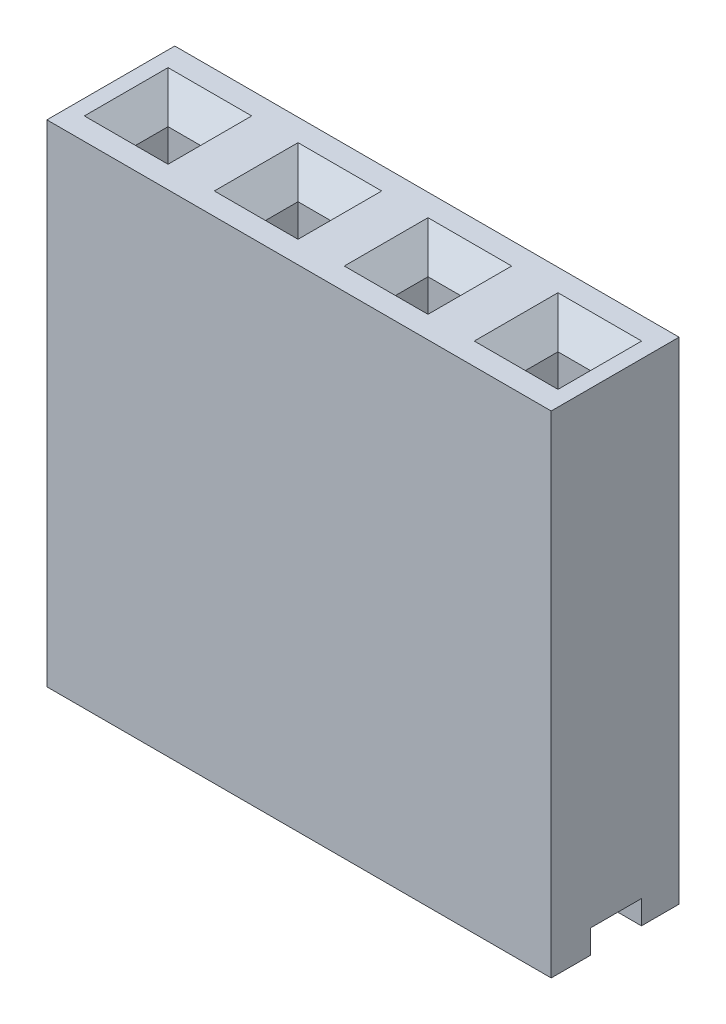
ISO-10303-21;
HEADER;
FILE_DESCRIPTION(('STEP AP214'),'2;1');
FILE_NAME('part.step','',(''),(''),'','','');
FILE_SCHEMA(('AUTOMOTIVE_DESIGN { 1 0 10303 214 1 1 1 1 }'));
ENDSEC;
DATA;
#1=APPLICATION_CONTEXT('core data for automotive mechanical design processes');
#2=APPLICATION_PROTOCOL_DEFINITION('international standard','automotive_design',2000,#1);
#3=PRODUCT_CONTEXT('',#1,'mechanical');
#4=PRODUCT('Part','Part','',(#3));
#5=PRODUCT_RELATED_PRODUCT_CATEGORY('part','',(#4));
#6=PRODUCT_DEFINITION_FORMATION('','',#4);
#7=PRODUCT_DEFINITION_CONTEXT('part definition',#1,'design');
#8=PRODUCT_DEFINITION('design','',#6,#7);
#9=PRODUCT_DEFINITION_SHAPE('','',#8);
#10=(LENGTH_UNIT() NAMED_UNIT(*) SI_UNIT(.MILLI.,.METRE.));
#11=(NAMED_UNIT(*) PLANE_ANGLE_UNIT() SI_UNIT($,.RADIAN.));
#12=(NAMED_UNIT(*) SI_UNIT($,.STERADIAN.) SOLID_ANGLE_UNIT());
#13=UNCERTAINTY_MEASURE_WITH_UNIT(LENGTH_MEASURE(1.E-05),#10,'distance_accuracy_value','');
#14=(GEOMETRIC_REPRESENTATION_CONTEXT(3) GLOBAL_UNCERTAINTY_ASSIGNED_CONTEXT((#13)) GLOBAL_UNIT_ASSIGNED_CONTEXT((#10,
#11,#12)) REPRESENTATION_CONTEXT('',''));
#15=CARTESIAN_POINT('',(0.,0.,0.));
#16=DIRECTION('',(0.,0.,1.));
#17=DIRECTION('',(1.,0.,0.));
#18=AXIS2_PLACEMENT_3D('',#15,#16,#17);
#19=CARTESIAN_POINT('',(0.,0.,0.));
#20=DIRECTION('',(0.,-1.,0.));
#21=DIRECTION('',(0.,0.,-1.));
#22=AXIS2_PLACEMENT_3D('',#19,#20,#21);
#23=PLANE('',#22);
#24=DIRECTION('',(-1.,0.,0.));
#25=VECTOR('',#24,1.);
#26=CARTESIAN_POINT('',(9.859,0.,0.735633929966329));
#27=LINE('',#26,#25);
#28=CARTESIAN_POINT('',(9.859,0.,0.735633929966329));
#29=VERTEX_POINT('',#28);
#30=CARTESIAN_POINT('',(0.,0.,0.735633929966331));
#31=VERTEX_POINT('',#30);
#32=EDGE_CURVE('E241',#29,#31,#27,.T.);
#33=ORIENTED_EDGE('',*,*,#32,.T.);
#34=DIRECTION('',(0.,0.,1.));
#35=VECTOR('',#34,1.);
#36=CARTESIAN_POINT('',(0.,0.,0.));
#37=LINE('',#36,#35);
#38=CARTESIAN_POINT('',(0.,0.,0.));
#39=VERTEX_POINT('',#38);
#40=EDGE_CURVE('E269',#39,#31,#37,.T.);
#41=ORIENTED_EDGE('',*,*,#40,.F.);
#42=DIRECTION('',(-1.,0.,0.));
#43=VECTOR('',#42,1.);
#44=CARTESIAN_POINT('',(0.,0.,0.));
#45=LINE('',#44,#43);
#46=CARTESIAN_POINT('',(9.859,0.,0.));
#47=VERTEX_POINT('',#46);
#48=EDGE_CURVE('E263',#47,#39,#45,.T.);
#49=ORIENTED_EDGE('',*,*,#48,.F.);
#50=DIRECTION('',(0.,0.,-1.));
#51=VECTOR('',#50,1.);
#52=CARTESIAN_POINT('',(9.859,0.,0.));
#53=LINE('',#52,#51);
#54=EDGE_CURVE('E255',#29,#47,#53,.T.);
#55=ORIENTED_EDGE('',*,*,#54,.F.);
#56=EDGE_LOOP('',(#33,#41,#49,#55));
#57=FACE_BOUND('',#56,.T.);
#58=ADVANCED_FACE('F33',(#57),#23,.T.);
#59=CARTESIAN_POINT('',(0.,9.6,0.));
#60=DIRECTION('',(0.,-1.,0.));
#61=DIRECTION('',(0.,0.,-1.));
#62=AXIS2_PLACEMENT_3D('',#59,#60,#61);
#63=PLANE('',#62);
#64=DIRECTION('',(0.,0.,1.));
#65=VECTOR('',#64,1.);
#66=CARTESIAN_POINT('',(9.559,9.6,1.568));
#67=LINE('',#66,#65);
#68=CARTESIAN_POINT('',(9.559,9.6,0.431999999999998));
#69=VERTEX_POINT('',#68);
#70=CARTESIAN_POINT('',(9.55899999999999,9.6,2.068));
#71=VERTEX_POINT('',#70);
#72=EDGE_CURVE('E340',#69,#71,#67,.T.);
#73=ORIENTED_EDGE('',*,*,#72,.T.);
#74=DIRECTION('',(-1.,0.,0.));
#75=VECTOR('',#74,1.);
#76=CARTESIAN_POINT('',(8.423,9.6,2.068));
#77=LINE('',#76,#75);
#78=CARTESIAN_POINT('',(7.92299999999999,9.6,2.068));
#79=VERTEX_POINT('',#78);
#80=EDGE_CURVE('E342',#71,#79,#77,.T.);
#81=ORIENTED_EDGE('',*,*,#80,.T.);
#82=DIRECTION('',(0.,0.,-1.));
#83=VECTOR('',#82,1.);
#84=CARTESIAN_POINT('',(7.92299999999999,9.6,0.932));
#85=LINE('',#84,#83);
#86=CARTESIAN_POINT('',(7.92299999999999,9.6,0.431999999999998));
#87=VERTEX_POINT('',#86);
#88=EDGE_CURVE('E336',#79,#87,#85,.T.);
#89=ORIENTED_EDGE('',*,*,#88,.T.);
#90=DIRECTION('',(1.,0.,0.));
#91=VECTOR('',#90,1.);
#92=CARTESIAN_POINT('',(9.059,9.6,0.431999999999998));
#93=LINE('',#92,#91);
#94=EDGE_CURVE('E338',#87,#69,#93,.T.);
#95=ORIENTED_EDGE('',*,*,#94,.T.);
#96=EDGE_LOOP('',(#73,#81,#89,#95));
#97=FACE_BOUND('',#96,.T.);
#98=DIRECTION('',(0.,0.,1.));
#99=VECTOR('',#98,1.);
#100=CARTESIAN_POINT('',(7.018,9.6,1.568));
#101=LINE('',#100,#99);
#102=CARTESIAN_POINT('',(7.018,9.6,0.431999999999998));
#103=VERTEX_POINT('',#102);
#104=CARTESIAN_POINT('',(7.018,9.6,2.068));
#105=VERTEX_POINT('',#104);
#106=EDGE_CURVE('E331',#103,#105,#101,.T.);
#107=ORIENTED_EDGE('',*,*,#106,.T.);
#108=DIRECTION('',(-1.,0.,0.));
#109=VECTOR('',#108,1.);
#110=CARTESIAN_POINT('',(5.882,9.6,2.068));
#111=LINE('',#110,#109);
#112=CARTESIAN_POINT('',(5.382,9.6,2.068));
#113=VERTEX_POINT('',#112);
#114=EDGE_CURVE('E333',#105,#113,#111,.T.);
#115=ORIENTED_EDGE('',*,*,#114,.T.);
#116=DIRECTION('',(0.,0.,-1.));
#117=VECTOR('',#116,1.);
#118=CARTESIAN_POINT('',(5.382,9.6,0.932000000000001));
#119=LINE('',#118,#117);
#120=CARTESIAN_POINT('',(5.382,9.6,0.431999999999999));
#121=VERTEX_POINT('',#120);
#122=EDGE_CURVE('E327',#113,#121,#119,.T.);
#123=ORIENTED_EDGE('',*,*,#122,.T.);
#124=DIRECTION('',(1.,0.,0.));
#125=VECTOR('',#124,1.);
#126=CARTESIAN_POINT('',(6.518,9.6,0.431999999999998));
#127=LINE('',#126,#125);
#128=EDGE_CURVE('E329',#121,#103,#127,.T.);
#129=ORIENTED_EDGE('',*,*,#128,.T.);
#130=EDGE_LOOP('',(#107,#115,#123,#129));
#131=FACE_BOUND('',#130,.T.);
#132=DIRECTION('',(0.,0.,1.));
#133=VECTOR('',#132,1.);
#134=CARTESIAN_POINT('',(4.477,9.6,1.568));
#135=LINE('',#134,#133);
#136=CARTESIAN_POINT('',(4.477,9.6,0.431999999999999));
#137=VERTEX_POINT('',#136);
#138=CARTESIAN_POINT('',(4.477,9.6,2.068));
#139=VERTEX_POINT('',#138);
#140=EDGE_CURVE('E322',#137,#139,#135,.T.);
#141=ORIENTED_EDGE('',*,*,#140,.T.);
#142=DIRECTION('',(-1.,0.,0.));
#143=VECTOR('',#142,1.);
#144=CARTESIAN_POINT('',(3.341,9.6,2.068));
#145=LINE('',#144,#143);
#146=CARTESIAN_POINT('',(2.841,9.6,2.068));
#147=VERTEX_POINT('',#146);
#148=EDGE_CURVE('E324',#139,#147,#145,.T.);
#149=ORIENTED_EDGE('',*,*,#148,.T.);
#150=DIRECTION('',(0.,0.,-1.));
#151=VECTOR('',#150,1.);
#152=CARTESIAN_POINT('',(2.841,9.6,0.932));
#153=LINE('',#152,#151);
#154=CARTESIAN_POINT('',(2.841,9.6,0.431999999999998));
#155=VERTEX_POINT('',#154);
#156=EDGE_CURVE('E318',#147,#155,#153,.T.);
#157=ORIENTED_EDGE('',*,*,#156,.T.);
#158=DIRECTION('',(1.,0.,0.));
#159=VECTOR('',#158,1.);
#160=CARTESIAN_POINT('',(3.977,9.6,0.431999999999999));
#161=LINE('',#160,#159);
#162=EDGE_CURVE('E320',#155,#137,#161,.T.);
#163=ORIENTED_EDGE('',*,*,#162,.T.);
#164=EDGE_LOOP('',(#141,#149,#157,#163));
#165=FACE_BOUND('',#164,.T.);
#166=DIRECTION('',(0.,0.,1.));
#167=VECTOR('',#166,1.);
#168=CARTESIAN_POINT('',(1.936,9.6,1.568));
#169=LINE('',#168,#167);
#170=CARTESIAN_POINT('',(1.936,9.6,0.431999999999999));
#171=VERTEX_POINT('',#170);
#172=CARTESIAN_POINT('',(1.936,9.6,2.068));
#173=VERTEX_POINT('',#172);
#174=EDGE_CURVE('E292',#171,#173,#169,.T.);
#175=ORIENTED_EDGE('',*,*,#174,.T.);
#176=DIRECTION('',(-1.,0.,0.));
#177=VECTOR('',#176,1.);
#178=CARTESIAN_POINT('',(0.800000000000001,9.6,2.068));
#179=LINE('',#178,#177);
#180=CARTESIAN_POINT('',(0.3,9.6,2.068));
#181=VERTEX_POINT('',#180);
#182=EDGE_CURVE('E294',#173,#181,#179,.T.);
#183=ORIENTED_EDGE('',*,*,#182,.T.);
#184=DIRECTION('',(0.,0.,-1.));
#185=VECTOR('',#184,1.);
#186=CARTESIAN_POINT('',(0.3,9.6,0.932));
#187=LINE('',#186,#185);
#188=CARTESIAN_POINT('',(0.3,9.6,0.431999999999999));
#189=VERTEX_POINT('',#188);
#190=EDGE_CURVE('E288',#181,#189,#187,.T.);
#191=ORIENTED_EDGE('',*,*,#190,.T.);
#192=DIRECTION('',(1.,0.,0.));
#193=VECTOR('',#192,1.);
#194=CARTESIAN_POINT('',(1.436,9.6,0.431999999999999));
#195=LINE('',#194,#193);
#196=EDGE_CURVE('E290',#189,#171,#195,.T.);
#197=ORIENTED_EDGE('',*,*,#196,.T.);
#198=EDGE_LOOP('',(#175,#183,#191,#197));
#199=FACE_BOUND('',#198,.T.);
#200=DIRECTION('',(-1.,0.,0.));
#201=VECTOR('',#200,1.);
#202=CARTESIAN_POINT('',(0.,9.6,0.));
#203=LINE('',#202,#201);
#204=CARTESIAN_POINT('',(9.859,9.6,0.));
#205=VERTEX_POINT('',#204);
#206=CARTESIAN_POINT('',(0.,9.6,0.));
#207=VERTEX_POINT('',#206);
#208=EDGE_CURVE('E268',#205,#207,#203,.T.);
#209=ORIENTED_EDGE('',*,*,#208,.T.);
#210=DIRECTION('',(0.,0.,1.));
#211=VECTOR('',#210,1.);
#212=CARTESIAN_POINT('',(0.,9.6,0.));
#213=LINE('',#212,#211);
#214=CARTESIAN_POINT('',(0.,9.6,2.5));
#215=VERTEX_POINT('',#214);
#216=EDGE_CURVE('E457',#207,#215,#213,.T.);
#217=ORIENTED_EDGE('',*,*,#216,.T.);
#218=DIRECTION('',(1.,0.,0.));
#219=VECTOR('',#218,1.);
#220=CARTESIAN_POINT('',(9.859,9.6,2.5));
#221=LINE('',#220,#219);
#222=CARTESIAN_POINT('',(9.859,9.6,2.5));
#223=VERTEX_POINT('',#222);
#224=EDGE_CURVE('E459',#215,#223,#221,.T.);
#225=ORIENTED_EDGE('',*,*,#224,.T.);
#226=DIRECTION('',(0.,0.,-1.));
#227=VECTOR('',#226,1.);
#228=CARTESIAN_POINT('',(9.859,9.6,0.));
#229=LINE('',#228,#227);
#230=EDGE_CURVE('E276',#223,#205,#229,.T.);
#231=ORIENTED_EDGE('',*,*,#230,.T.);
#232=EDGE_LOOP('',(#209,#217,#225,#231));
#233=FACE_BOUND('',#232,.T.);
#234=ADVANCED_FACE('F408',(#97,#131,#165,#199,#233),#63,.F.);
#235=DIRECTION('',(-1.,0.,0.));
#236=VECTOR('',#235,1.);
#237=CARTESIAN_POINT('',(9.859,0.,1.73658868639077));
#238=LINE('',#237,#236);
#239=CARTESIAN_POINT('',(9.859,0.,1.73658868639077));
#240=VERTEX_POINT('',#239);
#241=CARTESIAN_POINT('',(0.,0.,1.73658868639077));
#242=VERTEX_POINT('',#241);
#243=EDGE_CURVE('E250',#240,#242,#238,.T.);
#244=ORIENTED_EDGE('',*,*,#243,.F.);
#245=CARTESIAN_POINT('',(9.859,0.,2.5));
#246=VERTEX_POINT('',#245);
#247=EDGE_CURVE('E264',#246,#240,#53,.T.);
#248=ORIENTED_EDGE('',*,*,#247,.F.);
#249=DIRECTION('',(1.,0.,0.));
#250=VECTOR('',#249,1.);
#251=CARTESIAN_POINT('',(9.859,0.,2.5));
#252=LINE('',#251,#250);
#253=CARTESIAN_POINT('',(0.,0.,2.5));
#254=VERTEX_POINT('',#253);
#255=EDGE_CURVE('E265',#254,#246,#252,.T.);
#256=ORIENTED_EDGE('',*,*,#255,.F.);
#257=EDGE_CURVE('E462',#242,#254,#37,.T.);
#258=ORIENTED_EDGE('',*,*,#257,.F.);
#259=EDGE_LOOP('',(#244,#248,#256,#258));
#260=FACE_BOUND('',#259,.T.);
#261=ADVANCED_FACE('F479',(#260),#23,.T.);
#262=CARTESIAN_POINT('',(0.,9.6,0.));
#263=DIRECTION('',(0.,0.,1.));
#264=DIRECTION('',(1.,0.,0.));
#265=AXIS2_PLACEMENT_3D('',#262,#263,#264);
#266=PLANE('',#265);
#267=ORIENTED_EDGE('',*,*,#48,.T.);
#268=DIRECTION('',(0.,-1.,0.));
#269=VECTOR('',#268,1.);
#270=CARTESIAN_POINT('',(0.,9.6,0.));
#271=LINE('',#270,#269);
#272=EDGE_CURVE('E282',#207,#39,#271,.T.);
#273=ORIENTED_EDGE('',*,*,#272,.F.);
#274=ORIENTED_EDGE('',*,*,#208,.F.);
#275=DIRECTION('',(0.,-1.,0.));
#276=VECTOR('',#275,1.);
#277=CARTESIAN_POINT('',(9.859,9.6,0.));
#278=LINE('',#277,#276);
#279=EDGE_CURVE('E273',#205,#47,#278,.T.);
#280=ORIENTED_EDGE('',*,*,#279,.T.);
#281=EDGE_LOOP('',(#267,#273,#274,#280));
#282=FACE_BOUND('',#281,.T.);
#283=ADVANCED_FACE('F485',(#282),#266,.F.);
#284=CARTESIAN_POINT('',(0.,9.6,0.));
#285=DIRECTION('',(1.,0.,0.));
#286=DIRECTION('',(0.,0.,-1.));
#287=AXIS2_PLACEMENT_3D('',#284,#285,#286);
#288=PLANE('',#287);
#289=ORIENTED_EDGE('',*,*,#40,.T.);
#290=DIRECTION('',(0.,-1.,0.));
#291=VECTOR('',#290,1.);
#292=CARTESIAN_POINT('',(0.,0.,0.735633929966331));
#293=LINE('',#292,#291);
#294=CARTESIAN_POINT('',(0.,0.463176593244917,0.735633929966331));
#295=VERTEX_POINT('',#294);
#296=EDGE_CURVE('E246',#295,#31,#293,.T.);
#297=ORIENTED_EDGE('',*,*,#296,.F.);
#298=DIRECTION('',(0.,0.,-1.));
#299=VECTOR('',#298,1.);
#300=CARTESIAN_POINT('',(0.,0.463176593244917,0.735633929966331));
#301=LINE('',#300,#299);
#302=CARTESIAN_POINT('',(0.,0.463176593244917,1.73658868639077));
#303=VERTEX_POINT('',#302);
#304=EDGE_CURVE('E259',#303,#295,#301,.T.);
#305=ORIENTED_EDGE('',*,*,#304,.F.);
#306=DIRECTION('',(0.,1.,0.));
#307=VECTOR('',#306,1.);
#308=CARTESIAN_POINT('',(0.,0.,1.73658868639077));
#309=LINE('',#308,#307);
#310=EDGE_CURVE('E471',#242,#303,#309,.T.);
#311=ORIENTED_EDGE('',*,*,#310,.F.);
#312=ORIENTED_EDGE('',*,*,#257,.T.);
#313=DIRECTION('',(0.,-1.,0.));
#314=VECTOR('',#313,1.);
#315=CARTESIAN_POINT('',(0.,9.6,2.5));
#316=LINE('',#315,#314);
#317=EDGE_CURVE('E279',#215,#254,#316,.T.);
#318=ORIENTED_EDGE('',*,*,#317,.F.);
#319=ORIENTED_EDGE('',*,*,#216,.F.);
#320=ORIENTED_EDGE('',*,*,#272,.T.);
#321=EDGE_LOOP('',(#289,#297,#305,#311,#312,#318,#319,#320));
#322=FACE_BOUND('',#321,.T.);
#323=ADVANCED_FACE('F467',(#322),#288,.F.);
#324=CARTESIAN_POINT('',(9.859,9.6,2.5));
#325=DIRECTION('',(0.,0.,-1.));
#326=DIRECTION('',(-1.,0.,0.));
#327=AXIS2_PLACEMENT_3D('',#324,#325,#326);
#328=PLANE('',#327);
#329=ORIENTED_EDGE('',*,*,#255,.T.);
#330=DIRECTION('',(0.,-1.,0.));
#331=VECTOR('',#330,1.);
#332=CARTESIAN_POINT('',(9.859,9.6,2.5));
#333=LINE('',#332,#331);
#334=EDGE_CURVE('E275',#223,#246,#333,.T.);
#335=ORIENTED_EDGE('',*,*,#334,.F.);
#336=ORIENTED_EDGE('',*,*,#224,.F.);
#337=ORIENTED_EDGE('',*,*,#317,.T.);
#338=EDGE_LOOP('',(#329,#335,#336,#337));
#339=FACE_BOUND('',#338,.T.);
#340=ADVANCED_FACE('F476',(#339),#328,.F.);
#341=CARTESIAN_POINT('',(9.859,9.6,0.));
#342=DIRECTION('',(-1.,0.,0.));
#343=DIRECTION('',(0.,0.,1.));
#344=AXIS2_PLACEMENT_3D('',#341,#342,#343);
#345=PLANE('',#344);
#346=DIRECTION('',(0.,0.,-1.));
#347=VECTOR('',#346,1.);
#348=CARTESIAN_POINT('',(9.859,0.463176593244917,0.735633929966329));
#349=LINE('',#348,#347);
#350=CARTESIAN_POINT('',(9.859,0.463176593244918,1.73658868639077));
#351=VERTEX_POINT('',#350);
#352=CARTESIAN_POINT('',(9.859,0.463176593244917,0.735633929966329));
#353=VERTEX_POINT('',#352);
#354=EDGE_CURVE('E48',#351,#353,#349,.T.);
#355=ORIENTED_EDGE('',*,*,#354,.T.);
#356=DIRECTION('',(0.,-1.,0.));
#357=VECTOR('',#356,1.);
#358=CARTESIAN_POINT('',(9.859,0.,0.735633929966329));
#359=LINE('',#358,#357);
#360=EDGE_CURVE('E244',#353,#29,#359,.T.);
#361=ORIENTED_EDGE('',*,*,#360,.T.);
#362=ORIENTED_EDGE('',*,*,#54,.T.);
#363=ORIENTED_EDGE('',*,*,#279,.F.);
#364=ORIENTED_EDGE('',*,*,#230,.F.);
#365=ORIENTED_EDGE('',*,*,#334,.T.);
#366=ORIENTED_EDGE('',*,*,#247,.T.);
#367=DIRECTION('',(0.,1.,0.));
#368=VECTOR('',#367,1.);
#369=CARTESIAN_POINT('',(9.859,0.,1.73658868639077));
#370=LINE('',#369,#368);
#371=EDGE_CURVE('E258',#240,#351,#370,.T.);
#372=ORIENTED_EDGE('',*,*,#371,.T.);
#373=EDGE_LOOP('',(#355,#361,#362,#363,#364,#365,#366,#372));
#374=FACE_BOUND('',#373,.T.);
#375=ADVANCED_FACE('F253',(#374),#345,.F.);
#376=CARTESIAN_POINT('',(0.800000000000001,9.6,0.932));
#377=DIRECTION('',(1.,0.,0.));
#378=DIRECTION('',(0.,0.,-1.));
#379=AXIS2_PLACEMENT_3D('',#376,#377,#378);
#380=PLANE('',#379);
#381=DIRECTION('',(0.,0.,1.));
#382=VECTOR('',#381,1.);
#383=CARTESIAN_POINT('',(0.800000000000001,0.463176593244916,0.932));
#384=LINE('',#383,#382);
#385=CARTESIAN_POINT('',(0.800000000000001,0.463176593244916,0.932));
#386=VERTEX_POINT('',#385);
#387=CARTESIAN_POINT('',(0.800000000000001,0.463176593244916,1.568));
#388=VERTEX_POINT('',#387);
#389=EDGE_CURVE('E391',#386,#388,#384,.T.);
#390=ORIENTED_EDGE('',*,*,#389,.F.);
#391=DIRECTION('',(0.,-1.,0.));
#392=VECTOR('',#391,1.);
#393=CARTESIAN_POINT('',(0.800000000000001,9.6,0.932));
#394=LINE('',#393,#392);
#395=CARTESIAN_POINT('',(0.800000000000001,9.1,0.932));
#396=VERTEX_POINT('',#395);
#397=EDGE_CURVE('E443',#396,#386,#394,.T.);
#398=ORIENTED_EDGE('',*,*,#397,.F.);
#399=DIRECTION('',(0.,0.,1.));
#400=VECTOR('',#399,1.);
#401=CARTESIAN_POINT('',(0.800000000000001,9.1,1.568));
#402=LINE('',#401,#400);
#403=CARTESIAN_POINT('',(0.800000000000001,9.1,1.568));
#404=VERTEX_POINT('',#403);
#405=EDGE_CURVE('E301',#396,#404,#402,.T.);
#406=ORIENTED_EDGE('',*,*,#405,.T.);
#407=DIRECTION('',(0.,-1.,0.));
#408=VECTOR('',#407,1.);
#409=CARTESIAN_POINT('',(0.800000000000001,9.6,1.568));
#410=LINE('',#409,#408);
#411=EDGE_CURVE('E452',#404,#388,#410,.T.);
#412=ORIENTED_EDGE('',*,*,#411,.T.);
#413=EDGE_LOOP('',(#390,#398,#406,#412));
#414=FACE_BOUND('',#413,.T.);
#415=ADVANCED_FACE('F505',(#414),#380,.T.);
#416=CARTESIAN_POINT('',(0.800000000000001,9.6,1.568));
#417=DIRECTION('',(0.,0.,-1.));
#418=DIRECTION('',(-1.,0.,0.));
#419=AXIS2_PLACEMENT_3D('',#416,#417,#418);
#420=PLANE('',#419);
#421=DIRECTION('',(1.,0.,0.));
#422=VECTOR('',#421,1.);
#423=CARTESIAN_POINT('',(0.800000000000001,0.463176593244916,1.568));
#424=LINE('',#423,#422);
#425=CARTESIAN_POINT('',(1.436,0.463176593244916,1.568));
#426=VERTEX_POINT('',#425);
#427=EDGE_CURVE('E909',#388,#426,#424,.T.);
#428=ORIENTED_EDGE('',*,*,#427,.F.);
#429=ORIENTED_EDGE('',*,*,#411,.F.);
#430=DIRECTION('',(1.,0.,0.));
#431=VECTOR('',#430,1.);
#432=CARTESIAN_POINT('',(1.436,9.1,1.568));
#433=LINE('',#432,#431);
#434=CARTESIAN_POINT('',(1.436,9.1,1.568));
#435=VERTEX_POINT('',#434);
#436=EDGE_CURVE('E285',#404,#435,#433,.T.);
#437=ORIENTED_EDGE('',*,*,#436,.T.);
#438=DIRECTION('',(0.,-1.,0.));
#439=VECTOR('',#438,1.);
#440=CARTESIAN_POINT('',(1.436,9.6,1.568));
#441=LINE('',#440,#439);
#442=EDGE_CURVE('E449',#435,#426,#441,.T.);
#443=ORIENTED_EDGE('',*,*,#442,.T.);
#444=EDGE_LOOP('',(#428,#429,#437,#443));
#445=FACE_BOUND('',#444,.T.);
#446=ADVANCED_FACE('F522',(#445),#420,.T.);
#447=CARTESIAN_POINT('',(1.436,9.6,0.932));
#448=DIRECTION('',(-1.,0.,0.));
#449=DIRECTION('',(0.,0.,1.));
#450=AXIS2_PLACEMENT_3D('',#447,#448,#449);
#451=PLANE('',#450);
#452=DIRECTION('',(0.,0.,-1.));
#453=VECTOR('',#452,1.);
#454=CARTESIAN_POINT('',(1.436,0.463176593244916,0.932));
#455=LINE('',#454,#453);
#456=CARTESIAN_POINT('',(1.436,0.463176593244916,0.932));
#457=VERTEX_POINT('',#456);
#458=EDGE_CURVE('E56',#426,#457,#455,.T.);
#459=ORIENTED_EDGE('',*,*,#458,.F.);
#460=ORIENTED_EDGE('',*,*,#442,.F.);
#461=DIRECTION('',(0.,0.,-1.));
#462=VECTOR('',#461,1.);
#463=CARTESIAN_POINT('',(1.436,9.1,0.932));
#464=LINE('',#463,#462);
#465=CARTESIAN_POINT('',(1.436,9.1,0.932));
#466=VERTEX_POINT('',#465);
#467=EDGE_CURVE('E297',#435,#466,#464,.T.);
#468=ORIENTED_EDGE('',*,*,#467,.T.);
#469=DIRECTION('',(0.,-1.,0.));
#470=VECTOR('',#469,1.);
#471=CARTESIAN_POINT('',(1.436,9.6,0.932));
#472=LINE('',#471,#470);
#473=EDGE_CURVE('E446',#466,#457,#472,.T.);
#474=ORIENTED_EDGE('',*,*,#473,.T.);
#475=EDGE_LOOP('',(#459,#460,#468,#474));
#476=FACE_BOUND('',#475,.T.);
#477=ADVANCED_FACE('F529',(#476),#451,.T.);
#478=CARTESIAN_POINT('',(0.800000000000001,9.6,0.932));
#479=DIRECTION('',(0.,0.,1.));
#480=DIRECTION('',(1.,0.,0.));
#481=AXIS2_PLACEMENT_3D('',#478,#479,#480);
#482=PLANE('',#481);
#483=DIRECTION('',(-1.,0.,0.));
#484=VECTOR('',#483,1.);
#485=CARTESIAN_POINT('',(0.800000000000001,0.463176593244916,0.932));
#486=LINE('',#485,#484);
#487=EDGE_CURVE('E906',#457,#386,#486,.T.);
#488=ORIENTED_EDGE('',*,*,#487,.F.);
#489=ORIENTED_EDGE('',*,*,#473,.F.);
#490=DIRECTION('',(-1.,0.,0.));
#491=VECTOR('',#490,1.);
#492=CARTESIAN_POINT('',(0.800000000000001,9.1,0.932));
#493=LINE('',#492,#491);
#494=EDGE_CURVE('E299',#466,#396,#493,.T.);
#495=ORIENTED_EDGE('',*,*,#494,.T.);
#496=ORIENTED_EDGE('',*,*,#397,.T.);
#497=EDGE_LOOP('',(#488,#489,#495,#496));
#498=FACE_BOUND('',#497,.T.);
#499=ADVANCED_FACE('F537',(#498),#482,.T.);
#500=CARTESIAN_POINT('',(3.977,9.6,0.932000000000001));
#501=DIRECTION('',(0.,0.,1.));
#502=DIRECTION('',(1.,0.,0.));
#503=AXIS2_PLACEMENT_3D('',#500,#501,#502);
#504=PLANE('',#503);
#505=DIRECTION('',(-1.,0.,0.));
#506=VECTOR('',#505,1.);
#507=CARTESIAN_POINT('',(3.977,0.463176593244916,0.932000000000001));
#508=LINE('',#507,#506);
#509=CARTESIAN_POINT('',(3.977,0.463176593244916,0.932000000000001));
#510=VERTEX_POINT('',#509);
#511=CARTESIAN_POINT('',(3.341,0.463176593244916,0.932));
#512=VERTEX_POINT('',#511);
#513=EDGE_CURVE('E904',#510,#512,#508,.T.);
#514=ORIENTED_EDGE('',*,*,#513,.F.);
#515=DIRECTION('',(0.,-1.,0.));
#516=VECTOR('',#515,1.);
#517=CARTESIAN_POINT('',(3.977,9.6,0.932000000000001));
#518=LINE('',#517,#516);
#519=CARTESIAN_POINT('',(3.977,9.1,0.932000000000001));
#520=VERTEX_POINT('',#519);
#521=EDGE_CURVE('E433',#520,#510,#518,.T.);
#522=ORIENTED_EDGE('',*,*,#521,.F.);
#523=DIRECTION('',(-1.,0.,0.));
#524=VECTOR('',#523,1.);
#525=CARTESIAN_POINT('',(3.341,9.1,0.932));
#526=LINE('',#525,#524);
#527=CARTESIAN_POINT('',(3.341,9.1,0.932));
#528=VERTEX_POINT('',#527);
#529=EDGE_CURVE('E365',#520,#528,#526,.T.);
#530=ORIENTED_EDGE('',*,*,#529,.T.);
#531=DIRECTION('',(0.,-1.,0.));
#532=VECTOR('',#531,1.);
#533=CARTESIAN_POINT('',(3.341,9.6,0.932));
#534=LINE('',#533,#532);
#535=EDGE_CURVE('E435',#528,#512,#534,.T.);
#536=ORIENTED_EDGE('',*,*,#535,.T.);
#537=EDGE_LOOP('',(#514,#522,#530,#536));
#538=FACE_BOUND('',#537,.T.);
#539=ADVANCED_FACE('F545',(#538),#504,.T.);
#540=CARTESIAN_POINT('',(3.341,9.6,0.932));
#541=DIRECTION('',(1.,0.,0.));
#542=DIRECTION('',(0.,0.,-1.));
#543=AXIS2_PLACEMENT_3D('',#540,#541,#542);
#544=PLANE('',#543);
#545=DIRECTION('',(0.,0.,1.));
#546=VECTOR('',#545,1.);
#547=CARTESIAN_POINT('',(3.341,0.463176593244916,0.932));
#548=LINE('',#547,#546);
#549=CARTESIAN_POINT('',(3.341,0.463176593244916,1.568));
#550=VERTEX_POINT('',#549);
#551=EDGE_CURVE('E902',#512,#550,#548,.T.);
#552=ORIENTED_EDGE('',*,*,#551,.F.);
#553=ORIENTED_EDGE('',*,*,#535,.F.);
#554=DIRECTION('',(0.,0.,1.));
#555=VECTOR('',#554,1.);
#556=CARTESIAN_POINT('',(3.341,9.1,1.568));
#557=LINE('',#556,#555);
#558=CARTESIAN_POINT('',(3.341,9.1,1.568));
#559=VERTEX_POINT('',#558);
#560=EDGE_CURVE('E41',#528,#559,#557,.T.);
#561=ORIENTED_EDGE('',*,*,#560,.T.);
#562=DIRECTION('',(0.,-1.,0.));
#563=VECTOR('',#562,1.);
#564=CARTESIAN_POINT('',(3.341,9.6,1.568));
#565=LINE('',#564,#563);
#566=EDGE_CURVE('E429',#559,#550,#565,.T.);
#567=ORIENTED_EDGE('',*,*,#566,.T.);
#568=EDGE_LOOP('',(#552,#553,#561,#567));
#569=FACE_BOUND('',#568,.T.);
#570=ADVANCED_FACE('F553',(#569),#544,.T.);
#571=CARTESIAN_POINT('',(3.977,9.6,1.568));
#572=DIRECTION('',(0.,0.,-1.));
#573=DIRECTION('',(-1.,0.,0.));
#574=AXIS2_PLACEMENT_3D('',#571,#572,#573);
#575=PLANE('',#574);
#576=DIRECTION('',(1.,0.,0.));
#577=VECTOR('',#576,1.);
#578=CARTESIAN_POINT('',(3.977,0.463176593244916,1.568));
#579=LINE('',#578,#577);
#580=CARTESIAN_POINT('',(3.977,0.463176593244916,1.568));
#581=VERTEX_POINT('',#580);
#582=EDGE_CURVE('E900',#550,#581,#579,.T.);
#583=ORIENTED_EDGE('',*,*,#582,.F.);
#584=ORIENTED_EDGE('',*,*,#566,.F.);
#585=DIRECTION('',(1.,0.,0.));
#586=VECTOR('',#585,1.);
#587=CARTESIAN_POINT('',(3.977,9.1,1.568));
#588=LINE('',#587,#586);
#589=CARTESIAN_POINT('',(3.977,9.1,1.568));
#590=VERTEX_POINT('',#589);
#591=EDGE_CURVE('E360',#559,#590,#588,.T.);
#592=ORIENTED_EDGE('',*,*,#591,.T.);
#593=DIRECTION('',(0.,-1.,0.));
#594=VECTOR('',#593,1.);
#595=CARTESIAN_POINT('',(3.977,9.6,1.568));
#596=LINE('',#595,#594);
#597=EDGE_CURVE('E427',#590,#581,#596,.T.);
#598=ORIENTED_EDGE('',*,*,#597,.T.);
#599=EDGE_LOOP('',(#583,#584,#592,#598));
#600=FACE_BOUND('',#599,.T.);
#601=ADVANCED_FACE('F426',(#600),#575,.T.);
#602=CARTESIAN_POINT('',(3.977,9.6,0.932000000000001));
#603=DIRECTION('',(-1.,0.,0.));
#604=DIRECTION('',(0.,0.,1.));
#605=AXIS2_PLACEMENT_3D('',#602,#603,#604);
#606=PLANE('',#605);
#607=DIRECTION('',(0.,0.,-1.));
#608=VECTOR('',#607,1.);
#609=CARTESIAN_POINT('',(3.977,0.463176593244916,0.932000000000001));
#610=LINE('',#609,#608);
#611=EDGE_CURVE('E432',#581,#510,#610,.T.);
#612=ORIENTED_EDGE('',*,*,#611,.F.);
#613=ORIENTED_EDGE('',*,*,#597,.F.);
#614=DIRECTION('',(0.,0.,-1.));
#615=VECTOR('',#614,1.);
#616=CARTESIAN_POINT('',(3.977,9.1,0.932000000000001));
#617=LINE('',#616,#615);
#618=EDGE_CURVE('E363',#590,#520,#617,.T.);
#619=ORIENTED_EDGE('',*,*,#618,.T.);
#620=ORIENTED_EDGE('',*,*,#521,.T.);
#621=EDGE_LOOP('',(#612,#613,#619,#620));
#622=FACE_BOUND('',#621,.T.);
#623=ADVANCED_FACE('F431',(#622),#606,.T.);
#624=CARTESIAN_POINT('',(9.059,9.6,0.932));
#625=DIRECTION('',(0.,0.,1.));
#626=DIRECTION('',(1.,0.,0.));
#627=AXIS2_PLACEMENT_3D('',#624,#625,#626);
#628=PLANE('',#627);
#629=DIRECTION('',(-1.,0.,0.));
#630=VECTOR('',#629,1.);
#631=CARTESIAN_POINT('',(9.059,0.463176593244916,0.932));
#632=LINE('',#631,#630);
#633=CARTESIAN_POINT('',(9.059,0.463176593244916,0.932));
#634=VERTEX_POINT('',#633);
#635=CARTESIAN_POINT('',(8.423,0.463176593244916,0.932));
#636=VERTEX_POINT('',#635);
#637=EDGE_CURVE('E897',#634,#636,#632,.T.);
#638=ORIENTED_EDGE('',*,*,#637,.F.);
#639=DIRECTION('',(0.,-1.,0.));
#640=VECTOR('',#639,1.);
#641=CARTESIAN_POINT('',(9.059,9.6,0.932));
#642=LINE('',#641,#640);
#643=CARTESIAN_POINT('',(9.059,9.1,0.932));
#644=VERTEX_POINT('',#643);
#645=EDGE_CURVE('E923',#644,#634,#642,.T.);
#646=ORIENTED_EDGE('',*,*,#645,.F.);
#647=DIRECTION('',(-1.,0.,0.));
#648=VECTOR('',#647,1.);
#649=CARTESIAN_POINT('',(8.423,9.1,0.932));
#650=LINE('',#649,#648);
#651=CARTESIAN_POINT('',(8.423,9.1,0.932));
#652=VERTEX_POINT('',#651);
#653=EDGE_CURVE('E347',#644,#652,#650,.T.);
#654=ORIENTED_EDGE('',*,*,#653,.T.);
#655=DIRECTION('',(0.,-1.,0.));
#656=VECTOR('',#655,1.);
#657=CARTESIAN_POINT('',(8.423,9.6,0.932));
#658=LINE('',#657,#656);
#659=EDGE_CURVE('E437',#652,#636,#658,.T.);
#660=ORIENTED_EDGE('',*,*,#659,.T.);
#661=EDGE_LOOP('',(#638,#646,#654,#660));
#662=FACE_BOUND('',#661,.T.);
#663=ADVANCED_FACE('F574',(#662),#628,.T.);
#664=CARTESIAN_POINT('',(8.423,9.6,0.932));
#665=DIRECTION('',(1.,0.,0.));
#666=DIRECTION('',(0.,0.,-1.));
#667=AXIS2_PLACEMENT_3D('',#664,#665,#666);
#668=PLANE('',#667);
#669=DIRECTION('',(0.,0.,1.));
#670=VECTOR('',#669,1.);
#671=CARTESIAN_POINT('',(8.423,0.463176593244916,0.932));
#672=LINE('',#671,#670);
#673=CARTESIAN_POINT('',(8.423,0.463176593244916,1.568));
#674=VERTEX_POINT('',#673);
#675=EDGE_CURVE('E895',#636,#674,#672,.T.);
#676=ORIENTED_EDGE('',*,*,#675,.F.);
#677=ORIENTED_EDGE('',*,*,#659,.F.);
#678=DIRECTION('',(0.,0.,1.));
#679=VECTOR('',#678,1.);
#680=CARTESIAN_POINT('',(8.423,9.1,1.568));
#681=LINE('',#680,#679);
#682=CARTESIAN_POINT('',(8.423,9.1,1.568));
#683=VERTEX_POINT('',#682);
#684=EDGE_CURVE('E349',#652,#683,#681,.T.);
#685=ORIENTED_EDGE('',*,*,#684,.T.);
#686=DIRECTION('',(0.,-1.,0.));
#687=VECTOR('',#686,1.);
#688=CARTESIAN_POINT('',(8.423,9.6,1.568));
#689=LINE('',#688,#687);
#690=EDGE_CURVE('E929',#683,#674,#689,.T.);
#691=ORIENTED_EDGE('',*,*,#690,.T.);
#692=EDGE_LOOP('',(#676,#677,#685,#691));
#693=FACE_BOUND('',#692,.T.);
#694=ADVANCED_FACE('F581',(#693),#668,.T.);
#695=CARTESIAN_POINT('',(9.05899999999999,9.6,1.568));
#696=DIRECTION('',(0.,0.,-1.));
#697=DIRECTION('',(-1.,0.,0.));
#698=AXIS2_PLACEMENT_3D('',#695,#696,#697);
#699=PLANE('',#698);
#700=DIRECTION('',(1.,0.,0.));
#701=VECTOR('',#700,1.);
#702=CARTESIAN_POINT('',(9.05899999999999,0.463176593244916,1.568));
#703=LINE('',#702,#701);
#704=CARTESIAN_POINT('',(9.05899999999999,0.463176593244916,1.568));
#705=VERTEX_POINT('',#704);
#706=EDGE_CURVE('E893',#674,#705,#703,.T.);
#707=ORIENTED_EDGE('',*,*,#706,.F.);
#708=ORIENTED_EDGE('',*,*,#690,.F.);
#709=DIRECTION('',(1.,0.,0.));
#710=VECTOR('',#709,1.);
#711=CARTESIAN_POINT('',(9.05899999999999,9.1,1.568));
#712=LINE('',#711,#710);
#713=CARTESIAN_POINT('',(9.05899999999999,9.1,1.568));
#714=VERTEX_POINT('',#713);
#715=EDGE_CURVE('E303',#683,#714,#712,.T.);
#716=ORIENTED_EDGE('',*,*,#715,.T.);
#717=DIRECTION('',(0.,-1.,0.));
#718=VECTOR('',#717,1.);
#719=CARTESIAN_POINT('',(9.05899999999999,9.6,1.568));
#720=LINE('',#719,#718);
#721=EDGE_CURVE('E926',#714,#705,#720,.T.);
#722=ORIENTED_EDGE('',*,*,#721,.T.);
#723=EDGE_LOOP('',(#707,#708,#716,#722));
#724=FACE_BOUND('',#723,.T.);
#725=ADVANCED_FACE('F589',(#724),#699,.T.);
#726=CARTESIAN_POINT('',(9.059,9.6,0.932));
#727=DIRECTION('',(-1.,0.,0.));
#728=DIRECTION('',(0.,0.,1.));
#729=AXIS2_PLACEMENT_3D('',#726,#727,#728);
#730=PLANE('',#729);
#731=DIRECTION('',(0.,0.,-1.));
#732=VECTOR('',#731,1.);
#733=CARTESIAN_POINT('',(9.059,0.463176593244916,0.932));
#734=LINE('',#733,#732);
#735=EDGE_CURVE('E891',#705,#634,#734,.T.);
#736=ORIENTED_EDGE('',*,*,#735,.F.);
#737=ORIENTED_EDGE('',*,*,#721,.F.);
#738=DIRECTION('',(0.,0.,-1.));
#739=VECTOR('',#738,1.);
#740=CARTESIAN_POINT('',(9.059,9.1,0.932));
#741=LINE('',#740,#739);
#742=EDGE_CURVE('E345',#714,#644,#741,.T.);
#743=ORIENTED_EDGE('',*,*,#742,.T.);
#744=ORIENTED_EDGE('',*,*,#645,.T.);
#745=EDGE_LOOP('',(#736,#737,#743,#744));
#746=FACE_BOUND('',#745,.T.);
#747=ADVANCED_FACE('F597',(#746),#730,.T.);
#748=CARTESIAN_POINT('',(5.882,9.6,0.932000000000001));
#749=DIRECTION('',(0.,0.,1.));
#750=DIRECTION('',(1.,0.,0.));
#751=AXIS2_PLACEMENT_3D('',#748,#749,#750);
#752=PLANE('',#751);
#753=DIRECTION('',(-1.,0.,0.));
#754=VECTOR('',#753,1.);
#755=CARTESIAN_POINT('',(5.882,0.463176593244916,0.932000000000001));
#756=LINE('',#755,#754);
#757=CARTESIAN_POINT('',(6.518,0.463176593244916,0.932));
#758=VERTEX_POINT('',#757);
#759=CARTESIAN_POINT('',(5.882,0.463176593244916,0.932000000000001));
#760=VERTEX_POINT('',#759);
#761=EDGE_CURVE('E889',#758,#760,#756,.T.);
#762=ORIENTED_EDGE('',*,*,#761,.F.);
#763=DIRECTION('',(0.,-1.,0.));
#764=VECTOR('',#763,1.);
#765=CARTESIAN_POINT('',(6.518,9.6,0.932));
#766=LINE('',#765,#764);
#767=CARTESIAN_POINT('',(6.518,9.1,0.932));
#768=VERTEX_POINT('',#767);
#769=EDGE_CURVE('E315',#768,#758,#766,.T.);
#770=ORIENTED_EDGE('',*,*,#769,.F.);
#771=DIRECTION('',(-1.,0.,0.));
#772=VECTOR('',#771,1.);
#773=CARTESIAN_POINT('',(5.882,9.1,0.932000000000001));
#774=LINE('',#773,#772);
#775=CARTESIAN_POINT('',(5.882,9.1,0.932000000000001));
#776=VERTEX_POINT('',#775);
#777=EDGE_CURVE('E356',#768,#776,#774,.T.);
#778=ORIENTED_EDGE('',*,*,#777,.T.);
#779=DIRECTION('',(0.,-1.,0.));
#780=VECTOR('',#779,1.);
#781=CARTESIAN_POINT('',(5.882,9.6,0.932000000000001));
#782=LINE('',#781,#780);
#783=EDGE_CURVE('E920',#776,#760,#782,.T.);
#784=ORIENTED_EDGE('',*,*,#783,.T.);
#785=EDGE_LOOP('',(#762,#770,#778,#784));
#786=FACE_BOUND('',#785,.T.);
#787=ADVANCED_FACE('F605',(#786),#752,.T.);
#788=CARTESIAN_POINT('',(5.882,9.6,0.932000000000001));
#789=DIRECTION('',(1.,0.,0.));
#790=DIRECTION('',(0.,0.,-1.));
#791=AXIS2_PLACEMENT_3D('',#788,#789,#790);
#792=PLANE('',#791);
#793=DIRECTION('',(0.,0.,1.));
#794=VECTOR('',#793,1.);
#795=CARTESIAN_POINT('',(5.882,0.463176593244916,0.932000000000001));
#796=LINE('',#795,#794);
#797=CARTESIAN_POINT('',(5.882,0.463176593244916,1.568));
#798=VERTEX_POINT('',#797);
#799=EDGE_CURVE('E887',#760,#798,#796,.T.);
#800=ORIENTED_EDGE('',*,*,#799,.F.);
#801=ORIENTED_EDGE('',*,*,#783,.F.);
#802=DIRECTION('',(0.,0.,1.));
#803=VECTOR('',#802,1.);
#804=CARTESIAN_POINT('',(5.882,9.1,1.568));
#805=LINE('',#804,#803);
#806=CARTESIAN_POINT('',(5.882,9.1,1.568));
#807=VERTEX_POINT('',#806);
#808=EDGE_CURVE('E358',#776,#807,#805,.T.);
#809=ORIENTED_EDGE('',*,*,#808,.T.);
#810=DIRECTION('',(0.,-1.,0.));
#811=VECTOR('',#810,1.);
#812=CARTESIAN_POINT('',(5.882,9.6,1.568));
#813=LINE('',#812,#811);
#814=EDGE_CURVE('E917',#807,#798,#813,.T.);
#815=ORIENTED_EDGE('',*,*,#814,.T.);
#816=EDGE_LOOP('',(#800,#801,#809,#815));
#817=FACE_BOUND('',#816,.T.);
#818=ADVANCED_FACE('F613',(#817),#792,.T.);
#819=CARTESIAN_POINT('',(5.882,9.6,1.568));
#820=DIRECTION('',(0.,0.,-1.));
#821=DIRECTION('',(-1.,0.,0.));
#822=AXIS2_PLACEMENT_3D('',#819,#820,#821);
#823=PLANE('',#822);
#824=DIRECTION('',(1.,0.,0.));
#825=VECTOR('',#824,1.);
#826=CARTESIAN_POINT('',(5.882,0.463176593244916,1.568));
#827=LINE('',#826,#825);
#828=CARTESIAN_POINT('',(6.518,0.463176593244916,1.568));
#829=VERTEX_POINT('',#828);
#830=EDGE_CURVE('E883',#798,#829,#827,.T.);
#831=ORIENTED_EDGE('',*,*,#830,.F.);
#832=ORIENTED_EDGE('',*,*,#814,.F.);
#833=DIRECTION('',(1.,0.,0.));
#834=VECTOR('',#833,1.);
#835=CARTESIAN_POINT('',(6.518,9.1,1.568));
#836=LINE('',#835,#834);
#837=CARTESIAN_POINT('',(6.518,9.1,1.568));
#838=VERTEX_POINT('',#837);
#839=EDGE_CURVE('E351',#807,#838,#836,.T.);
#840=ORIENTED_EDGE('',*,*,#839,.T.);
#841=DIRECTION('',(0.,-1.,0.));
#842=VECTOR('',#841,1.);
#843=CARTESIAN_POINT('',(6.518,9.6,1.568));
#844=LINE('',#843,#842);
#845=EDGE_CURVE('E914',#838,#829,#844,.T.);
#846=ORIENTED_EDGE('',*,*,#845,.T.);
#847=EDGE_LOOP('',(#831,#832,#840,#846));
#848=FACE_BOUND('',#847,.T.);
#849=ADVANCED_FACE('F621',(#848),#823,.T.);
#850=CARTESIAN_POINT('',(6.518,9.6,0.932));
#851=DIRECTION('',(-1.,0.,0.));
#852=DIRECTION('',(0.,0.,1.));
#853=AXIS2_PLACEMENT_3D('',#850,#851,#852);
#854=PLANE('',#853);
#855=DIRECTION('',(0.,0.,-1.));
#856=VECTOR('',#855,1.);
#857=CARTESIAN_POINT('',(6.518,0.463176593244916,0.932));
#858=LINE('',#857,#856);
#859=EDGE_CURVE('E11',#829,#758,#858,.T.);
#860=ORIENTED_EDGE('',*,*,#859,.F.);
#861=ORIENTED_EDGE('',*,*,#845,.F.);
#862=DIRECTION('',(0.,0.,-1.));
#863=VECTOR('',#862,1.);
#864=CARTESIAN_POINT('',(6.518,9.1,0.932));
#865=LINE('',#864,#863);
#866=EDGE_CURVE('E354',#838,#768,#865,.T.);
#867=ORIENTED_EDGE('',*,*,#866,.T.);
#868=ORIENTED_EDGE('',*,*,#769,.T.);
#869=EDGE_LOOP('',(#860,#861,#867,#868));
#870=FACE_BOUND('',#869,.T.);
#871=ADVANCED_FACE('F629',(#870),#854,.T.);
#872=CARTESIAN_POINT('',(0.800000000000001,9.1,0.932));
#873=DIRECTION('',(0.,0.707106781186549,0.707106781186546));
#874=DIRECTION('',(1.,0.,0.));
#875=AXIS2_PLACEMENT_3D('',#872,#873,#874);
#876=PLANE('',#875);
#877=DIRECTION('',(0.577350269189627,0.577350269189624,-0.577350269189627));
#878=VECTOR('',#877,1.);
#879=CARTESIAN_POINT('',(1.436,9.1,0.932));
#880=LINE('',#879,#878);
#881=EDGE_CURVE('E309',#171,#466,#880,.F.);
#882=ORIENTED_EDGE('',*,*,#881,.F.);
#883=ORIENTED_EDGE('',*,*,#196,.F.);
#884=DIRECTION('',(-0.577350269189627,0.577350269189624,-0.577350269189626));
#885=VECTOR('',#884,1.);
#886=CARTESIAN_POINT('',(0.800000000000001,9.1,0.932));
#887=LINE('',#886,#885);
#888=EDGE_CURVE('E312',#396,#189,#887,.T.);
#889=ORIENTED_EDGE('',*,*,#888,.F.);
#890=ORIENTED_EDGE('',*,*,#494,.F.);
#891=EDGE_LOOP('',(#882,#883,#889,#890));
#892=FACE_BOUND('',#891,.T.);
#893=ADVANCED_FACE('F637',(#892),#876,.T.);
#894=CARTESIAN_POINT('',(0.800000000000001,9.1,0.932));
#895=DIRECTION('',(0.707106781186546,0.707106781186549,0.));
#896=DIRECTION('',(0.,0.,-1.));
#897=AXIS2_PLACEMENT_3D('',#894,#895,#896);
#898=PLANE('',#897);
#899=ORIENTED_EDGE('',*,*,#888,.T.);
#900=ORIENTED_EDGE('',*,*,#190,.F.);
#901=DIRECTION('',(0.577350269189627,-0.577350269189624,-0.577350269189627));
#902=VECTOR('',#901,1.);
#903=CARTESIAN_POINT('',(0.800000000000001,9.1,1.568));
#904=LINE('',#903,#902);
#905=EDGE_CURVE('E306',#404,#181,#904,.F.);
#906=ORIENTED_EDGE('',*,*,#905,.F.);
#907=ORIENTED_EDGE('',*,*,#405,.F.);
#908=EDGE_LOOP('',(#899,#900,#906,#907));
#909=FACE_BOUND('',#908,.T.);
#910=ADVANCED_FACE('F645',(#909),#898,.T.);
#911=CARTESIAN_POINT('',(1.436,9.1,0.932));
#912=DIRECTION('',(-0.707106781186546,0.707106781186549,0.));
#913=DIRECTION('',(0.,0.,1.));
#914=AXIS2_PLACEMENT_3D('',#911,#912,#913);
#915=PLANE('',#914);
#916=ORIENTED_EDGE('',*,*,#881,.T.);
#917=ORIENTED_EDGE('',*,*,#467,.F.);
#918=DIRECTION('',(0.577350269189627,0.577350269189624,0.577350269189627));
#919=VECTOR('',#918,1.);
#920=CARTESIAN_POINT('',(1.224,8.888,1.356));
#921=LINE('',#920,#919);
#922=EDGE_CURVE('E304',#173,#435,#921,.F.);
#923=ORIENTED_EDGE('',*,*,#922,.F.);
#924=ORIENTED_EDGE('',*,*,#174,.F.);
#925=EDGE_LOOP('',(#916,#917,#923,#924));
#926=FACE_BOUND('',#925,.T.);
#927=ADVANCED_FACE('F653',(#926),#915,.T.);
#928=CARTESIAN_POINT('',(0.800000000000001,9.1,1.568));
#929=DIRECTION('',(0.,0.707106781186549,-0.707106781186546));
#930=DIRECTION('',(-1.,0.,0.));
#931=AXIS2_PLACEMENT_3D('',#928,#929,#930);
#932=PLANE('',#931);
#933=ORIENTED_EDGE('',*,*,#905,.T.);
#934=ORIENTED_EDGE('',*,*,#182,.F.);
#935=ORIENTED_EDGE('',*,*,#922,.T.);
#936=ORIENTED_EDGE('',*,*,#436,.F.);
#937=EDGE_LOOP('',(#933,#934,#935,#936));
#938=FACE_BOUND('',#937,.T.);
#939=ADVANCED_FACE('F661',(#938),#932,.T.);
#940=CARTESIAN_POINT('',(9.059,9.1,0.932));
#941=DIRECTION('',(0.,0.707106781186548,0.707106781186548));
#942=DIRECTION('',(1.,0.,0.));
#943=AXIS2_PLACEMENT_3D('',#940,#941,#942);
#944=PLANE('',#943);
#945=DIRECTION('',(0.577350269189626,0.577350269189626,-0.577350269189626));
#946=VECTOR('',#945,1.);
#947=CARTESIAN_POINT('',(9.059,9.1,0.932));
#948=LINE('',#947,#946);
#949=EDGE_CURVE('E373',#69,#644,#948,.F.);
#950=ORIENTED_EDGE('',*,*,#949,.F.);
#951=ORIENTED_EDGE('',*,*,#94,.F.);
#952=DIRECTION('',(-0.577350269189626,0.577350269189626,-0.577350269189626));
#953=VECTOR('',#952,1.);
#954=CARTESIAN_POINT('',(8.635,8.888,1.144));
#955=LINE('',#954,#953);
#956=EDGE_CURVE('E307',#652,#87,#955,.T.);
#957=ORIENTED_EDGE('',*,*,#956,.F.);
#958=ORIENTED_EDGE('',*,*,#653,.F.);
#959=EDGE_LOOP('',(#950,#951,#957,#958));
#960=FACE_BOUND('',#959,.T.);
#961=ADVANCED_FACE('F669',(#960),#944,.T.);
#962=CARTESIAN_POINT('',(8.423,9.1,0.932));
#963=DIRECTION('',(0.707106781186548,0.707106781186548,0.));
#964=DIRECTION('',(0.,0.,-1.));
#965=AXIS2_PLACEMENT_3D('',#962,#963,#964);
#966=PLANE('',#965);
#967=ORIENTED_EDGE('',*,*,#956,.T.);
#968=ORIENTED_EDGE('',*,*,#88,.F.);
#969=DIRECTION('',(0.577350269189626,-0.577350269189626,-0.577350269189626));
#970=VECTOR('',#969,1.);
#971=CARTESIAN_POINT('',(8.63499999999999,8.888,1.356));
#972=LINE('',#971,#970);
#973=EDGE_CURVE('E370',#683,#79,#972,.F.);
#974=ORIENTED_EDGE('',*,*,#973,.F.);
#975=ORIENTED_EDGE('',*,*,#684,.F.);
#976=EDGE_LOOP('',(#967,#968,#974,#975));
#977=FACE_BOUND('',#976,.T.);
#978=ADVANCED_FACE('F677',(#977),#966,.T.);
#979=CARTESIAN_POINT('',(9.059,9.1,0.932));
#980=DIRECTION('',(-0.707106781186548,0.707106781186547,0.));
#981=DIRECTION('',(0.,0.,1.));
#982=AXIS2_PLACEMENT_3D('',#979,#980,#981);
#983=PLANE('',#982);
#984=ORIENTED_EDGE('',*,*,#949,.T.);
#985=ORIENTED_EDGE('',*,*,#742,.F.);
#986=DIRECTION('',(0.577350269189624,0.577350269189627,0.577350269189627));
#987=VECTOR('',#986,1.);
#988=CARTESIAN_POINT('',(9.05899999999999,9.1,1.568));
#989=LINE('',#988,#987);
#990=EDGE_CURVE('E368',#71,#714,#989,.F.);
#991=ORIENTED_EDGE('',*,*,#990,.F.);
#992=ORIENTED_EDGE('',*,*,#72,.F.);
#993=EDGE_LOOP('',(#984,#985,#991,#992));
#994=FACE_BOUND('',#993,.T.);
#995=ADVANCED_FACE('F685',(#994),#983,.T.);
#996=CARTESIAN_POINT('',(9.05899999999999,9.1,1.568));
#997=DIRECTION('',(0.,0.707106781186548,-0.707106781186548));
#998=DIRECTION('',(-1.,0.,0.));
#999=AXIS2_PLACEMENT_3D('',#996,#997,#998);
#1000=PLANE('',#999);
#1001=ORIENTED_EDGE('',*,*,#973,.T.);
#1002=ORIENTED_EDGE('',*,*,#80,.F.);
#1003=ORIENTED_EDGE('',*,*,#990,.T.);
#1004=ORIENTED_EDGE('',*,*,#715,.F.);
#1005=EDGE_LOOP('',(#1001,#1002,#1003,#1004));
#1006=FACE_BOUND('',#1005,.T.);
#1007=ADVANCED_FACE('F693',(#1006),#1000,.T.);
#1008=CARTESIAN_POINT('',(5.882,9.1,0.932000000000001));
#1009=DIRECTION('',(0.,0.707106781186548,0.707106781186548));
#1010=DIRECTION('',(1.,0.,0.));
#1011=AXIS2_PLACEMENT_3D('',#1008,#1009,#1010);
#1012=PLANE('',#1011);
#1013=DIRECTION('',(0.577350269189626,0.577350269189625,-0.577350269189626));
#1014=VECTOR('',#1013,1.);
#1015=CARTESIAN_POINT('',(6.518,9.1,0.932));
#1016=LINE('',#1015,#1014);
#1017=EDGE_CURVE('E383',#103,#768,#1016,.F.);
#1018=ORIENTED_EDGE('',*,*,#1017,.F.);
#1019=ORIENTED_EDGE('',*,*,#128,.F.);
#1020=DIRECTION('',(-0.577350269189626,0.577350269189626,-0.577350269189626));
#1021=VECTOR('',#1020,1.);
#1022=CARTESIAN_POINT('',(5.882,9.1,0.932000000000001));
#1023=LINE('',#1022,#1021);
#1024=EDGE_CURVE('E371',#776,#121,#1023,.T.);
#1025=ORIENTED_EDGE('',*,*,#1024,.F.);
#1026=ORIENTED_EDGE('',*,*,#777,.F.);
#1027=EDGE_LOOP('',(#1018,#1019,#1025,#1026));
#1028=FACE_BOUND('',#1027,.T.);
#1029=ADVANCED_FACE('F701',(#1028),#1012,.T.);
#1030=CARTESIAN_POINT('',(5.882,9.1,0.932000000000001));
#1031=DIRECTION('',(0.707106781186548,0.707106781186547,0.));
#1032=DIRECTION('',(0.,0.,-1.));
#1033=AXIS2_PLACEMENT_3D('',#1030,#1031,#1032);
#1034=PLANE('',#1033);
#1035=ORIENTED_EDGE('',*,*,#1024,.T.);
#1036=ORIENTED_EDGE('',*,*,#122,.F.);
#1037=DIRECTION('',(0.577350269189625,-0.577350269189627,-0.577350269189626));
#1038=VECTOR('',#1037,1.);
#1039=CARTESIAN_POINT('',(5.882,9.1,1.568));
#1040=LINE('',#1039,#1038);
#1041=EDGE_CURVE('E380',#807,#113,#1040,.F.);
#1042=ORIENTED_EDGE('',*,*,#1041,.F.);
#1043=ORIENTED_EDGE('',*,*,#808,.F.);
#1044=EDGE_LOOP('',(#1035,#1036,#1042,#1043));
#1045=FACE_BOUND('',#1044,.T.);
#1046=ADVANCED_FACE('F709',(#1045),#1034,.T.);
#1047=CARTESIAN_POINT('',(6.518,9.1,0.932));
#1048=DIRECTION('',(-0.707106781186547,0.707106781186548,0.));
#1049=DIRECTION('',(0.,0.,1.));
#1050=AXIS2_PLACEMENT_3D('',#1047,#1048,#1049);
#1051=PLANE('',#1050);
#1052=ORIENTED_EDGE('',*,*,#1017,.T.);
#1053=ORIENTED_EDGE('',*,*,#866,.F.);
#1054=DIRECTION('',(0.577350269189628,0.577350269189625,0.577350269189625));
#1055=VECTOR('',#1054,1.);
#1056=CARTESIAN_POINT('',(6.306,8.888,1.356));
#1057=LINE('',#1056,#1055);
#1058=EDGE_CURVE('E378',#105,#838,#1057,.F.);
#1059=ORIENTED_EDGE('',*,*,#1058,.F.);
#1060=ORIENTED_EDGE('',*,*,#106,.F.);
#1061=EDGE_LOOP('',(#1052,#1053,#1059,#1060));
#1062=FACE_BOUND('',#1061,.T.);
#1063=ADVANCED_FACE('F717',(#1062),#1051,.T.);
#1064=CARTESIAN_POINT('',(5.882,9.1,1.568));
#1065=DIRECTION('',(0.,0.707106781186547,-0.707106781186548));
#1066=DIRECTION('',(-1.,0.,0.));
#1067=AXIS2_PLACEMENT_3D('',#1064,#1065,#1066);
#1068=PLANE('',#1067);
#1069=ORIENTED_EDGE('',*,*,#1041,.T.);
#1070=ORIENTED_EDGE('',*,*,#114,.F.);
#1071=ORIENTED_EDGE('',*,*,#1058,.T.);
#1072=ORIENTED_EDGE('',*,*,#839,.F.);
#1073=EDGE_LOOP('',(#1069,#1070,#1071,#1072));
#1074=FACE_BOUND('',#1073,.T.);
#1075=ADVANCED_FACE('F725',(#1074),#1068,.T.);
#1076=CARTESIAN_POINT('',(3.977,9.1,0.932000000000001));
#1077=DIRECTION('',(0.,0.707106781186548,0.707106781186548));
#1078=DIRECTION('',(1.,0.,0.));
#1079=AXIS2_PLACEMENT_3D('',#1076,#1077,#1078);
#1080=PLANE('',#1079);
#1081=DIRECTION('',(0.577350269189626,0.577350269189626,-0.577350269189626));
#1082=VECTOR('',#1081,1.);
#1083=CARTESIAN_POINT('',(3.977,9.1,0.932000000000001));
#1084=LINE('',#1083,#1082);
#1085=EDGE_CURVE('E393',#137,#520,#1084,.F.);
#1086=ORIENTED_EDGE('',*,*,#1085,.F.);
#1087=ORIENTED_EDGE('',*,*,#162,.F.);
#1088=DIRECTION('',(-0.577350269189625,0.577350269189626,-0.577350269189626));
#1089=VECTOR('',#1088,1.);
#1090=CARTESIAN_POINT('',(3.553,8.888,1.144));
#1091=LINE('',#1090,#1089);
#1092=EDGE_CURVE('E381',#528,#155,#1091,.T.);
#1093=ORIENTED_EDGE('',*,*,#1092,.F.);
#1094=ORIENTED_EDGE('',*,*,#529,.F.);
#1095=EDGE_LOOP('',(#1086,#1087,#1093,#1094));
#1096=FACE_BOUND('',#1095,.T.);
#1097=ADVANCED_FACE('F35',(#1096),#1080,.T.);
#1098=CARTESIAN_POINT('',(3.341,9.1,0.932));
#1099=DIRECTION('',(0.707106781186548,0.707106781186548,0.));
#1100=DIRECTION('',(0.,0.,-1.));
#1101=AXIS2_PLACEMENT_3D('',#1098,#1099,#1100);
#1102=PLANE('',#1101);
#1103=ORIENTED_EDGE('',*,*,#1092,.T.);
#1104=ORIENTED_EDGE('',*,*,#156,.F.);
#1105=DIRECTION('',(0.577350269189627,-0.577350269189626,-0.577350269189625));
#1106=VECTOR('',#1105,1.);
#1107=CARTESIAN_POINT('',(3.553,8.888,1.356));
#1108=LINE('',#1107,#1106);
#1109=EDGE_CURVE('E390',#559,#147,#1108,.F.);
#1110=ORIENTED_EDGE('',*,*,#1109,.F.);
#1111=ORIENTED_EDGE('',*,*,#560,.F.);
#1112=EDGE_LOOP('',(#1103,#1104,#1110,#1111));
#1113=FACE_BOUND('',#1112,.T.);
#1114=ADVANCED_FACE('F400',(#1113),#1102,.T.);
#1115=CARTESIAN_POINT('',(3.977,9.1,0.932000000000001));
#1116=DIRECTION('',(-0.707106781186548,0.707106781186547,0.));
#1117=DIRECTION('',(0.,0.,1.));
#1118=AXIS2_PLACEMENT_3D('',#1115,#1116,#1117);
#1119=PLANE('',#1118);
#1120=ORIENTED_EDGE('',*,*,#1085,.T.);
#1121=ORIENTED_EDGE('',*,*,#618,.F.);
#1122=DIRECTION('',(0.577350269189624,0.577350269189627,0.577350269189627));
#1123=VECTOR('',#1122,1.);
#1124=CARTESIAN_POINT('',(3.977,9.1,1.568));
#1125=LINE('',#1124,#1123);
#1126=EDGE_CURVE('E388',#139,#590,#1125,.F.);
#1127=ORIENTED_EDGE('',*,*,#1126,.F.);
#1128=ORIENTED_EDGE('',*,*,#140,.F.);
#1129=EDGE_LOOP('',(#1120,#1121,#1127,#1128));
#1130=FACE_BOUND('',#1129,.T.);
#1131=ADVANCED_FACE('F417',(#1130),#1119,.T.);
#1132=CARTESIAN_POINT('',(3.977,9.1,1.568));
#1133=DIRECTION('',(0.,0.707106781186547,-0.707106781186548));
#1134=DIRECTION('',(-1.,0.,0.));
#1135=AXIS2_PLACEMENT_3D('',#1132,#1133,#1134);
#1136=PLANE('',#1135);
#1137=ORIENTED_EDGE('',*,*,#1109,.T.);
#1138=ORIENTED_EDGE('',*,*,#148,.F.);
#1139=ORIENTED_EDGE('',*,*,#1126,.T.);
#1140=ORIENTED_EDGE('',*,*,#591,.F.);
#1141=EDGE_LOOP('',(#1137,#1138,#1139,#1140));
#1142=FACE_BOUND('',#1141,.T.);
#1143=ADVANCED_FACE('F413',(#1142),#1136,.T.);
#1144=CARTESIAN_POINT('',(9.859,0.,0.735633929966329));
#1145=DIRECTION('',(0.,0.,-1.));
#1146=DIRECTION('',(-1.,0.,0.));
#1147=AXIS2_PLACEMENT_3D('',#1144,#1145,#1146);
#1148=PLANE('',#1147);
#1149=ORIENTED_EDGE('',*,*,#296,.T.);
#1150=ORIENTED_EDGE('',*,*,#32,.F.);
#1151=ORIENTED_EDGE('',*,*,#360,.F.);
#1152=DIRECTION('',(-1.,0.,0.));
#1153=VECTOR('',#1152,1.);
#1154=CARTESIAN_POINT('',(9.859,0.463176593244917,0.735633929966329));
#1155=LINE('',#1154,#1153);
#1156=EDGE_CURVE('E881',#353,#295,#1155,.T.);
#1157=ORIENTED_EDGE('',*,*,#1156,.T.);
#1158=EDGE_LOOP('',(#1149,#1150,#1151,#1157));
#1159=FACE_BOUND('',#1158,.T.);
#1160=ADVANCED_FACE('F243',(#1159),#1148,.F.);
#1161=CARTESIAN_POINT('',(9.859,0.463176593244917,0.735633929966329));
#1162=DIRECTION('',(0.,1.,0.));
#1163=DIRECTION('',(0.,0.,1.));
#1164=AXIS2_PLACEMENT_3D('',#1161,#1162,#1163);
#1165=PLANE('',#1164);
#1166=ORIENTED_EDGE('',*,*,#389,.T.);
#1167=ORIENTED_EDGE('',*,*,#427,.T.);
#1168=ORIENTED_EDGE('',*,*,#458,.T.);
#1169=ORIENTED_EDGE('',*,*,#487,.T.);
#1170=EDGE_LOOP('',(#1166,#1167,#1168,#1169));
#1171=FACE_BOUND('',#1170,.T.);
#1172=ORIENTED_EDGE('',*,*,#513,.T.);
#1173=ORIENTED_EDGE('',*,*,#551,.T.);
#1174=ORIENTED_EDGE('',*,*,#582,.T.);
#1175=ORIENTED_EDGE('',*,*,#611,.T.);
#1176=EDGE_LOOP('',(#1172,#1173,#1174,#1175));
#1177=FACE_BOUND('',#1176,.T.);
#1178=ORIENTED_EDGE('',*,*,#637,.T.);
#1179=ORIENTED_EDGE('',*,*,#675,.T.);
#1180=ORIENTED_EDGE('',*,*,#706,.T.);
#1181=ORIENTED_EDGE('',*,*,#735,.T.);
#1182=EDGE_LOOP('',(#1178,#1179,#1180,#1181));
#1183=FACE_BOUND('',#1182,.T.);
#1184=ORIENTED_EDGE('',*,*,#761,.T.);
#1185=ORIENTED_EDGE('',*,*,#799,.T.);
#1186=ORIENTED_EDGE('',*,*,#830,.T.);
#1187=ORIENTED_EDGE('',*,*,#859,.T.);
#1188=EDGE_LOOP('',(#1184,#1185,#1186,#1187));
#1189=FACE_BOUND('',#1188,.T.);
#1190=ORIENTED_EDGE('',*,*,#304,.T.);
#1191=ORIENTED_EDGE('',*,*,#1156,.F.);
#1192=ORIENTED_EDGE('',*,*,#354,.F.);
#1193=DIRECTION('',(-1.,0.,0.));
#1194=VECTOR('',#1193,1.);
#1195=CARTESIAN_POINT('',(9.859,0.463176593244917,1.73658868639077));
#1196=LINE('',#1195,#1194);
#1197=EDGE_CURVE('E875',#351,#303,#1196,.T.);
#1198=ORIENTED_EDGE('',*,*,#1197,.T.);
#1199=EDGE_LOOP('',(#1190,#1191,#1192,#1198));
#1200=FACE_BOUND('',#1199,.T.);
#1201=ADVANCED_FACE('F761',(#1171,#1177,#1183,#1189,#1200),#1165,.F.);
#1202=CARTESIAN_POINT('',(9.859,0.,1.73658868639077));
#1203=DIRECTION('',(0.,0.,1.));
#1204=DIRECTION('',(1.,0.,0.));
#1205=AXIS2_PLACEMENT_3D('',#1202,#1203,#1204);
#1206=PLANE('',#1205);
#1207=ORIENTED_EDGE('',*,*,#310,.T.);
#1208=ORIENTED_EDGE('',*,*,#1197,.F.);
#1209=ORIENTED_EDGE('',*,*,#371,.F.);
#1210=ORIENTED_EDGE('',*,*,#243,.T.);
#1211=EDGE_LOOP('',(#1207,#1208,#1209,#1210));
#1212=FACE_BOUND('',#1211,.T.);
#1213=ADVANCED_FACE('F768',(#1212),#1206,.F.);
#1214=CLOSED_SHELL('',(#58,#234,#261,#283,#323,#340,#375,#415,#446,#477,#499,#539,#570,#601,
#623,#663,#694,#725,#747,#787,#818,#849,#871,#893,#910,#927,#939,#961,#978,#995,#1007,#1029,
#1046,#1063,#1075,#1097,#1114,#1131,#1143,#1160,#1201,#1213));
#1215=MANIFOLD_SOLID_BREP('B2',#1214);
#1216=ADVANCED_BREP_SHAPE_REPRESENTATION('',(#18,#1215),#14);
#1217=SHAPE_DEFINITION_REPRESENTATION(#9,#1216);
ENDSEC;
END-ISO-10303-21;
